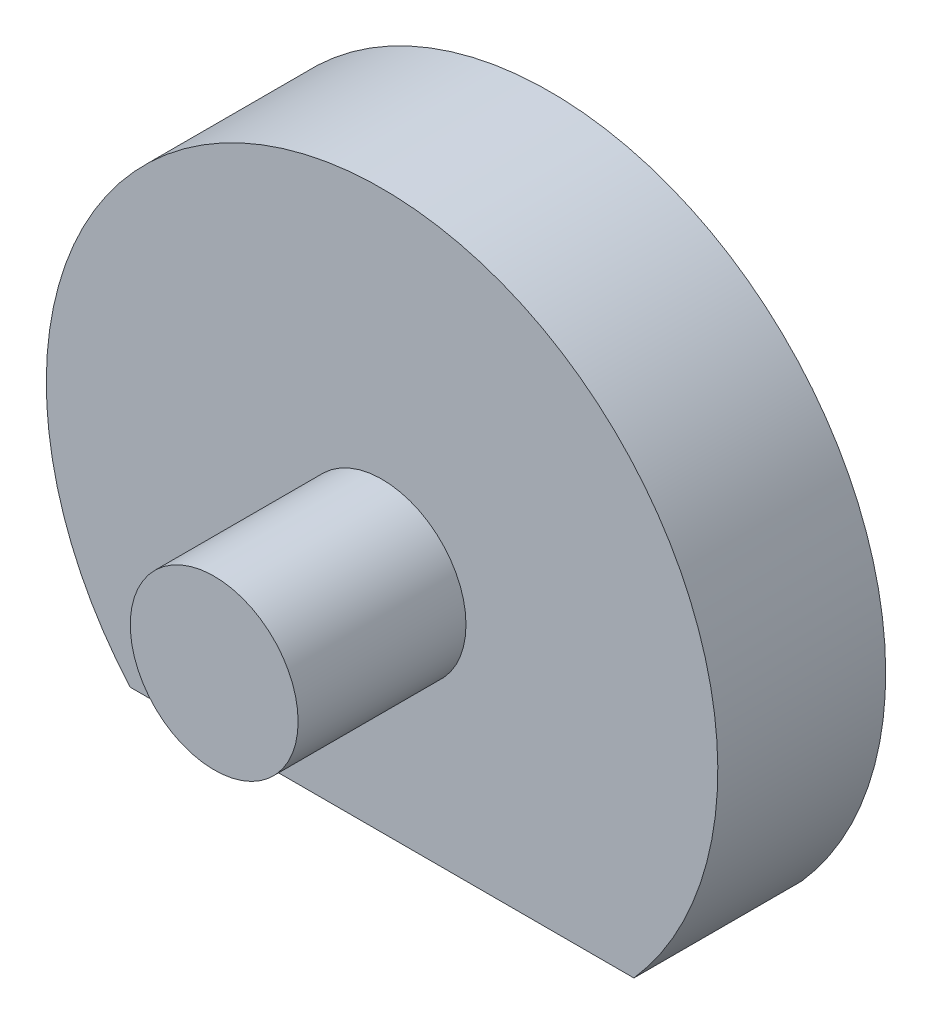
ISO-10303-21;
HEADER;
FILE_DESCRIPTION(('STEP AP214'),'2;1');
FILE_NAME('part.step','',(''),(''),'','','');
FILE_SCHEMA(('AUTOMOTIVE_DESIGN { 1 0 10303 214 1 1 1 1 }'));
ENDSEC;
DATA;
#1=APPLICATION_CONTEXT('core data for automotive mechanical design processes');
#2=APPLICATION_PROTOCOL_DEFINITION('international standard','automotive_design',2000,#1);
#3=PRODUCT_CONTEXT('',#1,'mechanical');
#4=PRODUCT('Part','Part','',(#3));
#5=PRODUCT_RELATED_PRODUCT_CATEGORY('part','',(#4));
#6=PRODUCT_DEFINITION_FORMATION('','',#4);
#7=PRODUCT_DEFINITION_CONTEXT('part definition',#1,'design');
#8=PRODUCT_DEFINITION('design','',#6,#7);
#9=PRODUCT_DEFINITION_SHAPE('','',#8);
#10=(LENGTH_UNIT() NAMED_UNIT(*) SI_UNIT(.MILLI.,.METRE.));
#11=(NAMED_UNIT(*) PLANE_ANGLE_UNIT() SI_UNIT($,.RADIAN.));
#12=(NAMED_UNIT(*) SI_UNIT($,.STERADIAN.) SOLID_ANGLE_UNIT());
#13=UNCERTAINTY_MEASURE_WITH_UNIT(LENGTH_MEASURE(1.E-05),#10,'distance_accuracy_value','');
#14=(GEOMETRIC_REPRESENTATION_CONTEXT(3) GLOBAL_UNCERTAINTY_ASSIGNED_CONTEXT((#13)) GLOBAL_UNIT_ASSIGNED_CONTEXT((#10,
#11,#12)) REPRESENTATION_CONTEXT('',''));
#15=CARTESIAN_POINT('',(0.,0.,0.));
#16=DIRECTION('',(0.,0.,1.));
#17=DIRECTION('',(1.,0.,0.));
#18=AXIS2_PLACEMENT_3D('',#15,#16,#17);
#19=CARTESIAN_POINT('',(-79.5647432619508,27.357918419449,-10.));
#20=DIRECTION('',(0.,0.,1.));
#21=DIRECTION('',(1.,0.,0.));
#22=AXIS2_PLACEMENT_3D('',#19,#20,#21);
#23=CYLINDRICAL_SURFACE('',#22,2.50000000000001);
#24=CARTESIAN_POINT('',(-79.5647432619508,27.357918419449,-5.));
#25=DIRECTION('',(0.,0.,1.));
#26=DIRECTION('',(1.,0.,0.));
#27=AXIS2_PLACEMENT_3D('',#24,#25,#26);
#28=CIRCLE('',#27,2.50000000000001);
#29=CARTESIAN_POINT('',(-77.0647432619508,27.357918419449,-5.));
#30=VERTEX_POINT('',#29);
#31=EDGE_CURVE('E11',#30,#30,#28,.F.);
#32=ORIENTED_EDGE('',*,*,#31,.F.);
#33=EDGE_LOOP('',(#32));
#34=FACE_BOUND('',#33,.T.);
#35=CARTESIAN_POINT('',(-79.5647432619508,27.357918419449,0.));
#36=DIRECTION('',(0.,0.,1.));
#37=DIRECTION('',(1.,0.,0.));
#38=AXIS2_PLACEMENT_3D('',#35,#36,#37);
#39=CIRCLE('',#38,2.50000000000001);
#40=CARTESIAN_POINT('',(-77.0647432619508,27.357918419449,0.));
#41=VERTEX_POINT('',#40);
#42=EDGE_CURVE('E42',#41,#41,#39,.T.);
#43=ORIENTED_EDGE('',*,*,#42,.F.);
#44=EDGE_LOOP('',(#43));
#45=FACE_BOUND('',#44,.T.);
#46=ADVANCED_FACE('F34',(#34,#45),#23,.T.);
#47=CARTESIAN_POINT('',(0.,0.,0.));
#48=DIRECTION('',(0.,0.,1.));
#49=DIRECTION('',(1.,0.,0.));
#50=AXIS2_PLACEMENT_3D('',#47,#48,#49);
#51=PLANE('',#50);
#52=ORIENTED_EDGE('',*,*,#42,.T.);
#53=EDGE_LOOP('',(#52));
#54=FACE_BOUND('',#53,.T.);
#55=ADVANCED_FACE('F80',(#54),#51,.T.);
#56=CARTESIAN_POINT('',(0.,20.7435401417875,-10.));
#57=DIRECTION('',(0.,-1.,0.));
#58=DIRECTION('',(1.,0.,0.));
#59=AXIS2_PLACEMENT_3D('',#56,#57,#58);
#60=PLANE('',#59);
#61=DIRECTION('',(1.,0.,0.));
#62=VECTOR('',#61,1.);
#63=CARTESIAN_POINT('',(0.,20.7435401417875,-5.));
#64=LINE('',#63,#62);
#65=CARTESIAN_POINT('',(-87.0647432619508,20.7435401417875,-5.));
#66=VERTEX_POINT('',#65);
#67=CARTESIAN_POINT('',(-72.0647432619508,20.7435401417875,-5.));
#68=VERTEX_POINT('',#67);
#69=EDGE_CURVE('E67',#66,#68,#64,.T.);
#70=ORIENTED_EDGE('',*,*,#69,.F.);
#71=DIRECTION('',(0.,0.,1.));
#72=VECTOR('',#71,1.);
#73=CARTESIAN_POINT('',(-87.0647432619508,20.7435401417875,-10.));
#74=LINE('',#73,#72);
#75=CARTESIAN_POINT('',(-87.0647432619508,20.7435401417875,-10.));
#76=VERTEX_POINT('',#75);
#77=EDGE_CURVE('E50',#76,#66,#74,.T.);
#78=ORIENTED_EDGE('',*,*,#77,.F.);
#79=DIRECTION('',(1.,0.,0.));
#80=VECTOR('',#79,1.);
#81=CARTESIAN_POINT('',(0.,20.7435401417875,-10.));
#82=LINE('',#81,#80);
#83=CARTESIAN_POINT('',(-72.0647432619508,20.7435401417875,-10.));
#84=VERTEX_POINT('',#83);
#85=EDGE_CURVE('E72',#76,#84,#82,.T.);
#86=ORIENTED_EDGE('',*,*,#85,.T.);
#87=DIRECTION('',(0.,0.,1.));
#88=VECTOR('',#87,1.);
#89=CARTESIAN_POINT('',(-72.0647432619508,20.7435401417875,-10.));
#90=LINE('',#89,#88);
#91=EDGE_CURVE('E56',#84,#68,#90,.T.);
#92=ORIENTED_EDGE('',*,*,#91,.T.);
#93=EDGE_LOOP('',(#70,#78,#86,#92));
#94=FACE_BOUND('',#93,.T.);
#95=ADVANCED_FACE('F68',(#94),#60,.T.);
#96=CARTESIAN_POINT('',(-79.5647432619508,27.357918419449,-10.));
#97=DIRECTION('',(0.,0.,1.));
#98=DIRECTION('',(1.,0.,0.));
#99=AXIS2_PLACEMENT_3D('',#96,#97,#98);
#100=CYLINDRICAL_SURFACE('',#99,10.);
#101=CARTESIAN_POINT('',(-79.5647432619508,27.357918419449,-5.));
#102=DIRECTION('',(0.,0.,1.));
#103=DIRECTION('',(1.,0.,0.));
#104=AXIS2_PLACEMENT_3D('',#101,#102,#103);
#105=CIRCLE('',#104,10.);
#106=EDGE_CURVE('E63',#68,#66,#105,.T.);
#107=ORIENTED_EDGE('',*,*,#106,.F.);
#108=ORIENTED_EDGE('',*,*,#91,.F.);
#109=CARTESIAN_POINT('',(-79.5647432619508,27.357918419449,-10.));
#110=DIRECTION('',(0.,0.,1.));
#111=DIRECTION('',(1.,0.,0.));
#112=AXIS2_PLACEMENT_3D('',#109,#110,#111);
#113=CIRCLE('',#112,10.);
#114=EDGE_CURVE('E65',#84,#76,#113,.T.);
#115=ORIENTED_EDGE('',*,*,#114,.T.);
#116=ORIENTED_EDGE('',*,*,#77,.T.);
#117=EDGE_LOOP('',(#107,#108,#115,#116));
#118=FACE_BOUND('',#117,.T.);
#119=ADVANCED_FACE('F61',(#118),#100,.T.);
#120=CARTESIAN_POINT('',(0.,0.,-5.));
#121=DIRECTION('',(0.,0.,1.));
#122=DIRECTION('',(1.,0.,0.));
#123=AXIS2_PLACEMENT_3D('',#120,#121,#122);
#124=PLANE('',#123);
#125=ORIENTED_EDGE('',*,*,#31,.T.);
#126=EDGE_LOOP('',(#125));
#127=FACE_BOUND('',#126,.T.);
#128=ORIENTED_EDGE('',*,*,#69,.T.);
#129=ORIENTED_EDGE('',*,*,#106,.T.);
#130=EDGE_LOOP('',(#128,#129));
#131=FACE_BOUND('',#130,.T.);
#132=ADVANCED_FACE('F71',(#127,#131),#124,.T.);
#133=CARTESIAN_POINT('',(0.,0.,-10.));
#134=DIRECTION('',(0.,0.,1.));
#135=DIRECTION('',(1.,0.,0.));
#136=AXIS2_PLACEMENT_3D('',#133,#134,#135);
#137=PLANE('',#136);
#138=ORIENTED_EDGE('',*,*,#85,.F.);
#139=ORIENTED_EDGE('',*,*,#114,.F.);
#140=EDGE_LOOP('',(#138,#139));
#141=FACE_BOUND('',#140,.T.);
#142=ADVANCED_FACE('F90',(#141),#137,.F.);
#143=CLOSED_SHELL('',(#46,#55,#95,#119,#132,#142));
#144=MANIFOLD_SOLID_BREP('B2',#143);
#145=ADVANCED_BREP_SHAPE_REPRESENTATION('',(#18,#144),#14);
#146=SHAPE_DEFINITION_REPRESENTATION(#9,#145);
ENDSEC;
END-ISO-10303-21;
